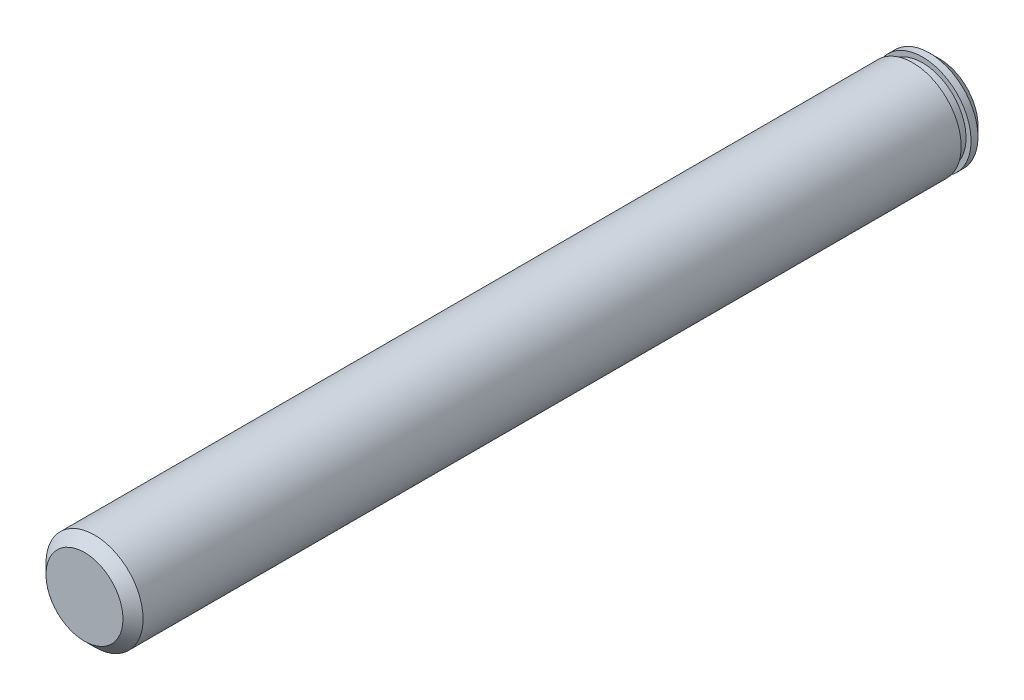
ISO-10303-21;
HEADER;
FILE_DESCRIPTION(('STEP AP214'),'2;1');
FILE_NAME('part.step','',(''),(''),'','','');
FILE_SCHEMA(('AUTOMOTIVE_DESIGN { 1 0 10303 214 1 1 1 1 }'));
ENDSEC;
DATA;
#1=APPLICATION_CONTEXT('core data for automotive mechanical design processes');
#2=APPLICATION_PROTOCOL_DEFINITION('international standard','automotive_design',2000,#1);
#3=PRODUCT_CONTEXT('',#1,'mechanical');
#4=PRODUCT('Part','Part','',(#3));
#5=PRODUCT_RELATED_PRODUCT_CATEGORY('part','',(#4));
#6=PRODUCT_DEFINITION_FORMATION('','',#4);
#7=PRODUCT_DEFINITION_CONTEXT('part definition',#1,'design');
#8=PRODUCT_DEFINITION('design','',#6,#7);
#9=PRODUCT_DEFINITION_SHAPE('','',#8);
#10=(LENGTH_UNIT() NAMED_UNIT(*) SI_UNIT(.MILLI.,.METRE.));
#11=(NAMED_UNIT(*) PLANE_ANGLE_UNIT() SI_UNIT($,.RADIAN.));
#12=(NAMED_UNIT(*) SI_UNIT($,.STERADIAN.) SOLID_ANGLE_UNIT());
#13=UNCERTAINTY_MEASURE_WITH_UNIT(LENGTH_MEASURE(1.E-05),#10,'distance_accuracy_value','');
#14=(GEOMETRIC_REPRESENTATION_CONTEXT(3) GLOBAL_UNCERTAINTY_ASSIGNED_CONTEXT((#13)) GLOBAL_UNIT_ASSIGNED_CONTEXT((#10,
#11,#12)) REPRESENTATION_CONTEXT('',''));
#15=CARTESIAN_POINT('',(0.,0.,0.));
#16=DIRECTION('',(0.,0.,1.));
#17=DIRECTION('',(1.,0.,0.));
#18=AXIS2_PLACEMENT_3D('',#15,#16,#17);
#19=CARTESIAN_POINT('',(0.,1.94289029309402E-13,85.0000000000001));
#20=DIRECTION('',(0.,0.,-1.));
#21=DIRECTION('',(-1.,0.,0.));
#22=AXIS2_PLACEMENT_3D('',#19,#20,#21);
#23=CYLINDRICAL_SURFACE('',#22,4.825);
#24=CARTESIAN_POINT('',(0.,4.16333634234434E-13,2.67000000000016));
#25=DIRECTION('',(0.,0.,-1.));
#26=DIRECTION('',(-1.,0.,0.));
#27=AXIS2_PLACEMENT_3D('',#24,#25,#26);
#28=CIRCLE('',#27,4.825);
#29=CARTESIAN_POINT('',(-4.825,3.98120425515458E-13,2.67000000000016));
#30=VERTEX_POINT('',#29);
#31=EDGE_CURVE('E75',#30,#30,#28,.T.);
#32=ORIENTED_EDGE('',*,*,#31,.F.);
#33=EDGE_LOOP('',(#32));
#34=FACE_BOUND('',#33,.T.);
#35=CARTESIAN_POINT('',(0.,2.77555756156289E-13,84.0000000000003));
#36=DIRECTION('',(0.,0.,1.));
#37=DIRECTION('',(1.,0.,0.));
#38=AXIS2_PLACEMENT_3D('',#35,#36,#37);
#39=CIRCLE('',#38,4.825);
#40=CARTESIAN_POINT('',(4.825,2.95768964875265E-13,84.0000000000003));
#41=VERTEX_POINT('',#40);
#42=EDGE_CURVE('E57',#41,#41,#39,.F.);
#43=ORIENTED_EDGE('',*,*,#42,.T.);
#44=EDGE_LOOP('',(#43));
#45=FACE_BOUND('',#44,.T.);
#46=ADVANCED_FACE('F48',(#34,#45),#23,.T.);
#47=CARTESIAN_POINT('',(0.,1.94289029309402E-13,85.0000000000001));
#48=DIRECTION('',(0.,0.,1.));
#49=DIRECTION('',(1.,0.,0.));
#50=AXIS2_PLACEMENT_3D('',#47,#48,#49);
#51=PLANE('',#50);
#52=CARTESIAN_POINT('',(0.,1.94289029309402E-13,85.0000000000001));
#53=DIRECTION('',(0.,0.,1.));
#54=DIRECTION('',(1.,0.,0.));
#55=AXIS2_PLACEMENT_3D('',#52,#53,#54);
#56=CIRCLE('',#55,3.82499999999999);
#57=CARTESIAN_POINT('',(3.82499999999994,2.08727479744653E-13,85.0000000000001));
#58=VERTEX_POINT('',#57);
#59=EDGE_CURVE('E69',#58,#58,#56,.T.);
#60=ORIENTED_EDGE('',*,*,#59,.T.);
#61=EDGE_LOOP('',(#60));
#62=FACE_BOUND('',#61,.T.);
#63=ADVANCED_FACE('F117',(#62),#51,.T.);
#64=CARTESIAN_POINT('',(0.,1.94289029309402E-13,85.0000000000001));
#65=DIRECTION('',(0.,0.,-1.));
#66=DIRECTION('',(-1.,0.,0.));
#67=AXIS2_PLACEMENT_3D('',#64,#65,#66);
#68=CONICAL_SURFACE('',#67,3.82499999999999,0.785398163397444);
#69=ORIENTED_EDGE('',*,*,#42,.F.);
#70=EDGE_LOOP('',(#69));
#71=FACE_BOUND('',#70,.T.);
#72=ORIENTED_EDGE('',*,*,#59,.F.);
#73=EDGE_LOOP('',(#72));
#74=FACE_BOUND('',#73,.T.);
#75=ADVANCED_FACE('F112',(#71,#74),#68,.T.);
#76=CARTESIAN_POINT('',(-4.82499999999997,0.,2.67000000000004));
#77=DIRECTION('',(0.,0.,1.));
#78=DIRECTION('',(1.,0.,0.));
#79=AXIS2_PLACEMENT_3D('',#76,#77,#78);
#80=PLANE('',#79);
#81=CARTESIAN_POINT('',(0.,4.16333634234434E-13,2.67000000000016));
#82=DIRECTION('',(0.,0.,-1.));
#83=DIRECTION('',(-1.,0.,0.));
#84=AXIS2_PLACEMENT_3D('',#81,#82,#83);
#85=CIRCLE('',#84,4.325);
#86=CARTESIAN_POINT('',(-4.325,4.00007804657321E-13,2.67000000000016));
#87=VERTEX_POINT('',#86);
#88=EDGE_CURVE('E79',#87,#87,#85,.T.);
#89=ORIENTED_EDGE('',*,*,#88,.F.);
#90=EDGE_LOOP('',(#89));
#91=FACE_BOUND('',#90,.T.);
#92=ORIENTED_EDGE('',*,*,#31,.T.);
#93=EDGE_LOOP('',(#92));
#94=FACE_BOUND('',#93,.T.);
#95=ADVANCED_FACE('F106',(#91,#94),#80,.F.);
#96=CARTESIAN_POINT('',(0.,0.,0.));
#97=DIRECTION('',(0.,0.,-1.));
#98=DIRECTION('',(-1.,0.,0.));
#99=AXIS2_PLACEMENT_3D('',#96,#97,#98);
#100=CYLINDRICAL_SURFACE('',#99,4.325);
#101=CARTESIAN_POINT('',(0.,0.,1.69000000000008));
#102=DIRECTION('',(0.,0.,-1.));
#103=DIRECTION('',(-1.,0.,0.));
#104=AXIS2_PLACEMENT_3D('',#101,#102,#103);
#105=CIRCLE('',#104,4.325);
#106=CARTESIAN_POINT('',(-4.325,0.,1.69000000000008));
#107=VERTEX_POINT('',#106);
#108=EDGE_CURVE('E83',#107,#107,#105,.T.);
#109=ORIENTED_EDGE('',*,*,#108,.F.);
#110=EDGE_LOOP('',(#109));
#111=FACE_BOUND('',#110,.T.);
#112=ORIENTED_EDGE('',*,*,#88,.T.);
#113=EDGE_LOOP('',(#112));
#114=FACE_BOUND('',#113,.T.);
#115=ADVANCED_FACE('F100',(#111,#114),#100,.T.);
#116=CARTESIAN_POINT('',(-4.82499999999986,5.82867087928207E-13,1.6900000000002));
#117=DIRECTION('',(0.,0.,-1.));
#118=DIRECTION('',(-1.,0.,0.));
#119=AXIS2_PLACEMENT_3D('',#116,#117,#118);
#120=PLANE('',#119);
#121=CARTESIAN_POINT('',(0.,0.,1.69000000000008));
#122=DIRECTION('',(0.,0.,-1.));
#123=DIRECTION('',(-1.,0.,0.));
#124=AXIS2_PLACEMENT_3D('',#121,#122,#123);
#125=CIRCLE('',#124,4.825);
#126=CARTESIAN_POINT('',(-4.825,0.,1.69000000000008));
#127=VERTEX_POINT('',#126);
#128=EDGE_CURVE('E87',#127,#127,#125,.T.);
#129=ORIENTED_EDGE('',*,*,#128,.F.);
#130=EDGE_LOOP('',(#129));
#131=FACE_BOUND('',#130,.T.);
#132=ORIENTED_EDGE('',*,*,#108,.T.);
#133=EDGE_LOOP('',(#132));
#134=FACE_BOUND('',#133,.T.);
#135=ADVANCED_FACE('F96',(#131,#134),#120,.F.);
#136=CARTESIAN_POINT('',(0.,0.,0.));
#137=DIRECTION('',(0.,0.,1.));
#138=DIRECTION('',(1.,0.,0.));
#139=AXIS2_PLACEMENT_3D('',#136,#137,#138);
#140=PLANE('',#139);
#141=CARTESIAN_POINT('',(0.,0.,0.));
#142=DIRECTION('',(0.,0.,1.));
#143=DIRECTION('',(1.,0.,0.));
#144=AXIS2_PLACEMENT_3D('',#141,#142,#143);
#145=CIRCLE('',#144,3.82499999999998);
#146=CARTESIAN_POINT('',(3.82499999999998,0.,0.));
#147=VERTEX_POINT('',#146);
#148=EDGE_CURVE('E12',#147,#147,#145,.F.);
#149=ORIENTED_EDGE('',*,*,#148,.T.);
#150=EDGE_LOOP('',(#149));
#151=FACE_BOUND('',#150,.T.);
#152=ADVANCED_FACE('F99',(#151),#140,.F.);
#153=CARTESIAN_POINT('',(1.11022302462516E-13,4.44089209850063E-13,1.00000000000008));
#154=DIRECTION('',(0.,0.,1.));
#155=DIRECTION('',(1.,0.,0.));
#156=AXIS2_PLACEMENT_3D('',#153,#154,#155);
#157=CONICAL_SURFACE('',#156,4.825,0.78539816339745);
#158=ORIENTED_EDGE('',*,*,#148,.F.);
#159=EDGE_LOOP('',(#158));
#160=FACE_BOUND('',#159,.T.);
#161=CARTESIAN_POINT('',(1.11022302462516E-13,4.44089209850063E-13,1.00000000000008));
#162=DIRECTION('',(0.,0.,1.));
#163=DIRECTION('',(1.,0.,0.));
#164=AXIS2_PLACEMENT_3D('',#161,#162,#163);
#165=CIRCLE('',#164,4.825);
#166=CARTESIAN_POINT('',(4.82500000000011,4.62302418569038E-13,1.00000000000008));
#167=VERTEX_POINT('',#166);
#168=EDGE_CURVE('E63',#167,#167,#165,.T.);
#169=ORIENTED_EDGE('',*,*,#168,.F.);
#170=EDGE_LOOP('',(#169));
#171=FACE_BOUND('',#170,.T.);
#172=ADVANCED_FACE('F51',(#160,#171),#157,.T.);
#173=ORIENTED_EDGE('',*,*,#128,.T.);
#174=EDGE_LOOP('',(#173));
#175=FACE_BOUND('',#174,.T.);
#176=ORIENTED_EDGE('',*,*,#168,.T.);
#177=EDGE_LOOP('',(#176));
#178=FACE_BOUND('',#177,.T.);
#179=ADVANCED_FACE('F93',(#175,#178),#23,.T.);
#180=CLOSED_SHELL('',(#46,#63,#75,#95,#115,#135,#152,#172,#179));
#181=MANIFOLD_SOLID_BREP('B2',#180);
#182=ADVANCED_BREP_SHAPE_REPRESENTATION('',(#18,#181),#14);
#183=SHAPE_DEFINITION_REPRESENTATION(#9,#182);
ENDSEC;
END-ISO-10303-21;
